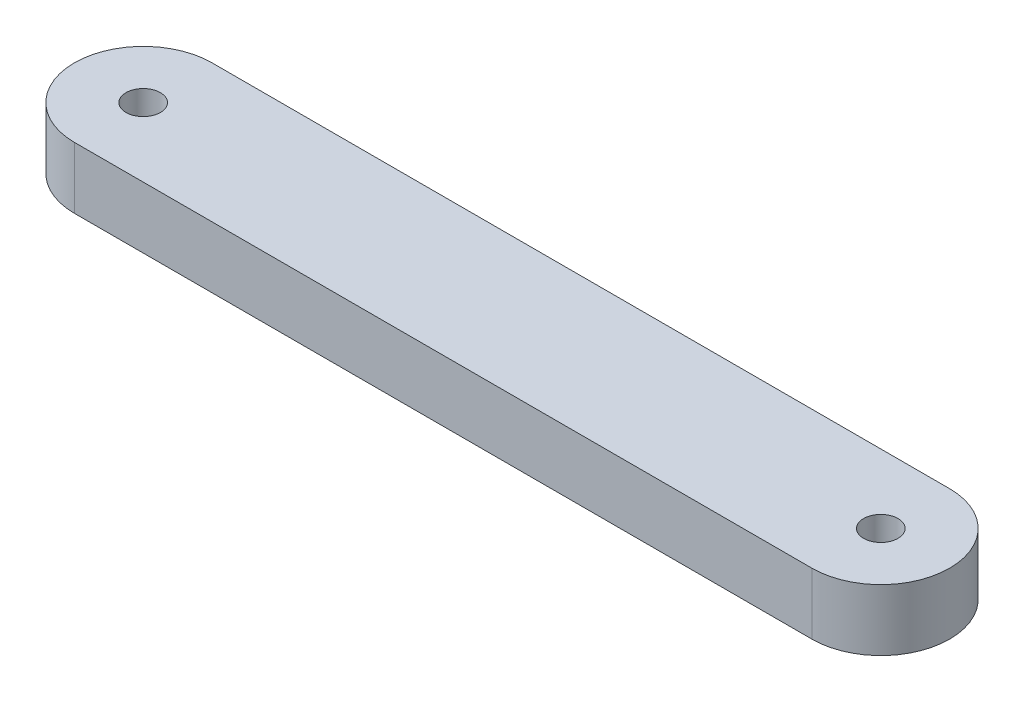
ISO-10303-21;
HEADER;
FILE_DESCRIPTION(('STEP AP214'),'2;1');
FILE_NAME('part.step','',(''),(''),'','','');
FILE_SCHEMA(('AUTOMOTIVE_DESIGN { 1 0 10303 214 1 1 1 1 }'));
ENDSEC;
DATA;
#1=APPLICATION_CONTEXT('core data for automotive mechanical design processes');
#2=APPLICATION_PROTOCOL_DEFINITION('international standard','automotive_design',2000,#1);
#3=PRODUCT_CONTEXT('',#1,'mechanical');
#4=PRODUCT('Part','Part','',(#3));
#5=PRODUCT_RELATED_PRODUCT_CATEGORY('part','',(#4));
#6=PRODUCT_DEFINITION_FORMATION('','',#4);
#7=PRODUCT_DEFINITION_CONTEXT('part definition',#1,'design');
#8=PRODUCT_DEFINITION('design','',#6,#7);
#9=PRODUCT_DEFINITION_SHAPE('','',#8);
#10=(LENGTH_UNIT() NAMED_UNIT(*) SI_UNIT(.MILLI.,.METRE.));
#11=(NAMED_UNIT(*) PLANE_ANGLE_UNIT() SI_UNIT($,.RADIAN.));
#12=(NAMED_UNIT(*) SI_UNIT($,.STERADIAN.) SOLID_ANGLE_UNIT());
#13=UNCERTAINTY_MEASURE_WITH_UNIT(LENGTH_MEASURE(1.E-05),#10,'distance_accuracy_value','');
#14=(GEOMETRIC_REPRESENTATION_CONTEXT(3) GLOBAL_UNCERTAINTY_ASSIGNED_CONTEXT((#13)) GLOBAL_UNIT_ASSIGNED_CONTEXT((#10,
#11,#12)) REPRESENTATION_CONTEXT('',''));
#15=CARTESIAN_POINT('',(0.,0.,0.));
#16=DIRECTION('',(0.,0.,1.));
#17=DIRECTION('',(1.,0.,0.));
#18=AXIS2_PLACEMENT_3D('',#15,#16,#17);
#19=CARTESIAN_POINT('',(0.,25.,28.));
#20=DIRECTION('',(0.,0.,1.));
#21=DIRECTION('',(1.,0.,0.));
#22=AXIS2_PLACEMENT_3D('',#19,#20,#21);
#23=PLANE('',#22);
#24=DIRECTION('',(-1.,0.,0.));
#25=VECTOR('',#24,1.);
#26=CARTESIAN_POINT('',(0.,0.,28.));
#27=LINE('',#26,#25);
#28=CARTESIAN_POINT('',(150.,0.,28.));
#29=VERTEX_POINT('',#28);
#30=CARTESIAN_POINT('',(-150.,0.,28.));
#31=VERTEX_POINT('',#30);
#32=EDGE_CURVE('E108',#29,#31,#27,.T.);
#33=ORIENTED_EDGE('',*,*,#32,.F.);
#34=DIRECTION('',(0.,-1.,0.));
#35=VECTOR('',#34,1.);
#36=CARTESIAN_POINT('',(150.,25.,28.));
#37=LINE('',#36,#35);
#38=CARTESIAN_POINT('',(150.,25.,28.));
#39=VERTEX_POINT('',#38);
#40=EDGE_CURVE('E11',#39,#29,#37,.T.);
#41=ORIENTED_EDGE('',*,*,#40,.F.);
#42=DIRECTION('',(-1.,0.,0.));
#43=VECTOR('',#42,1.);
#44=CARTESIAN_POINT('',(0.,25.,28.));
#45=LINE('',#44,#43);
#46=CARTESIAN_POINT('',(-150.,25.,28.));
#47=VERTEX_POINT('',#46);
#48=EDGE_CURVE('E95',#39,#47,#45,.T.);
#49=ORIENTED_EDGE('',*,*,#48,.T.);
#50=DIRECTION('',(0.,-1.,0.));
#51=VECTOR('',#50,1.);
#52=CARTESIAN_POINT('',(-150.,25.,28.));
#53=LINE('',#52,#51);
#54=EDGE_CURVE('E76',#47,#31,#53,.T.);
#55=ORIENTED_EDGE('',*,*,#54,.T.);
#56=EDGE_LOOP('',(#33,#41,#49,#55));
#57=FACE_BOUND('',#56,.T.);
#58=ADVANCED_FACE('F38',(#57),#23,.T.);
#59=CARTESIAN_POINT('',(150.,25.,0.));
#60=DIRECTION('',(0.,-1.,0.));
#61=DIRECTION('',(0.,0.,-1.));
#62=AXIS2_PLACEMENT_3D('',#59,#60,#61);
#63=CYLINDRICAL_SURFACE('',#62,28.);
#64=CARTESIAN_POINT('',(150.,0.,0.));
#65=DIRECTION('',(0.,1.,0.));
#66=DIRECTION('',(0.,0.,1.));
#67=AXIS2_PLACEMENT_3D('',#64,#65,#66);
#68=CIRCLE('',#67,28.);
#69=CARTESIAN_POINT('',(150.,0.,-28.0000000000001));
#70=VERTEX_POINT('',#69);
#71=EDGE_CURVE('E87',#70,#29,#68,.F.);
#72=ORIENTED_EDGE('',*,*,#71,.F.);
#73=DIRECTION('',(0.,-1.,0.));
#74=VECTOR('',#73,1.);
#75=CARTESIAN_POINT('',(150.,25.,-28.0000000000001));
#76=LINE('',#75,#74);
#77=CARTESIAN_POINT('',(150.,25.,-28.0000000000001));
#78=VERTEX_POINT('',#77);
#79=EDGE_CURVE('E46',#78,#70,#76,.T.);
#80=ORIENTED_EDGE('',*,*,#79,.F.);
#81=CARTESIAN_POINT('',(150.,25.,0.));
#82=DIRECTION('',(0.,1.,0.));
#83=DIRECTION('',(0.,0.,1.));
#84=AXIS2_PLACEMENT_3D('',#81,#82,#83);
#85=CIRCLE('',#84,28.);
#86=EDGE_CURVE('E85',#78,#39,#85,.F.);
#87=ORIENTED_EDGE('',*,*,#86,.T.);
#88=ORIENTED_EDGE('',*,*,#40,.T.);
#89=EDGE_LOOP('',(#72,#80,#87,#88));
#90=FACE_BOUND('',#89,.T.);
#91=ADVANCED_FACE('F84',(#90),#63,.T.);
#92=CARTESIAN_POINT('',(0.,25.,-28.0000000000001));
#93=DIRECTION('',(0.,0.,-1.));
#94=DIRECTION('',(-1.,0.,0.));
#95=AXIS2_PLACEMENT_3D('',#92,#93,#94);
#96=PLANE('',#95);
#97=DIRECTION('',(1.,0.,0.));
#98=VECTOR('',#97,1.);
#99=CARTESIAN_POINT('',(0.,0.,-28.0000000000001));
#100=LINE('',#99,#98);
#101=CARTESIAN_POINT('',(-150.,0.,-28.));
#102=VERTEX_POINT('',#101);
#103=EDGE_CURVE('E112',#102,#70,#100,.T.);
#104=ORIENTED_EDGE('',*,*,#103,.F.);
#105=DIRECTION('',(0.,-1.,0.));
#106=VECTOR('',#105,1.);
#107=CARTESIAN_POINT('',(-150.,25.,-28.));
#108=LINE('',#107,#106);
#109=CARTESIAN_POINT('',(-150.,25.,-28.));
#110=VERTEX_POINT('',#109);
#111=EDGE_CURVE('E69',#110,#102,#108,.T.);
#112=ORIENTED_EDGE('',*,*,#111,.F.);
#113=DIRECTION('',(1.,0.,0.));
#114=VECTOR('',#113,1.);
#115=CARTESIAN_POINT('',(0.,25.,-28.0000000000001));
#116=LINE('',#115,#114);
#117=EDGE_CURVE('E94',#110,#78,#116,.T.);
#118=ORIENTED_EDGE('',*,*,#117,.T.);
#119=ORIENTED_EDGE('',*,*,#79,.T.);
#120=EDGE_LOOP('',(#104,#112,#118,#119));
#121=FACE_BOUND('',#120,.T.);
#122=ADVANCED_FACE('F97',(#121),#96,.T.);
#123=CARTESIAN_POINT('',(-150.,25.,0.));
#124=DIRECTION('',(0.,-1.,0.));
#125=DIRECTION('',(0.,0.,-1.));
#126=AXIS2_PLACEMENT_3D('',#123,#124,#125);
#127=CYLINDRICAL_SURFACE('',#126,7.00000000000001);
#128=CARTESIAN_POINT('',(-150.,25.,0.));
#129=DIRECTION('',(0.,1.,0.));
#130=DIRECTION('',(0.,0.,1.));
#131=AXIS2_PLACEMENT_3D('',#128,#129,#130);
#132=CIRCLE('',#131,7.00000000000001);
#133=CARTESIAN_POINT('',(-150.,25.,7.00000000000001));
#134=VERTEX_POINT('',#133);
#135=EDGE_CURVE('E99',#134,#134,#132,.T.);
#136=ORIENTED_EDGE('',*,*,#135,.T.);
#137=EDGE_LOOP('',(#136));
#138=FACE_BOUND('',#137,.T.);
#139=CARTESIAN_POINT('',(-150.,0.,0.));
#140=DIRECTION('',(0.,1.,0.));
#141=DIRECTION('',(0.,0.,1.));
#142=AXIS2_PLACEMENT_3D('',#139,#140,#141);
#143=CIRCLE('',#142,7.00000000000001);
#144=CARTESIAN_POINT('',(-150.,0.,7.00000000000001));
#145=VERTEX_POINT('',#144);
#146=EDGE_CURVE('E116',#145,#145,#143,.T.);
#147=ORIENTED_EDGE('',*,*,#146,.F.);
#148=EDGE_LOOP('',(#147));
#149=FACE_BOUND('',#148,.T.);
#150=ADVANCED_FACE('F132',(#138,#149),#127,.F.);
#151=CARTESIAN_POINT('',(-150.,25.,0.));
#152=DIRECTION('',(0.,-1.,0.));
#153=DIRECTION('',(0.,0.,-1.));
#154=AXIS2_PLACEMENT_3D('',#151,#152,#153);
#155=CYLINDRICAL_SURFACE('',#154,28.);
#156=CARTESIAN_POINT('',(-150.,0.,0.));
#157=DIRECTION('',(0.,1.,0.));
#158=DIRECTION('',(0.,0.,1.));
#159=AXIS2_PLACEMENT_3D('',#156,#157,#158);
#160=CIRCLE('',#159,28.);
#161=EDGE_CURVE('E114',#102,#31,#160,.T.);
#162=ORIENTED_EDGE('',*,*,#161,.T.);
#163=ORIENTED_EDGE('',*,*,#54,.F.);
#164=CARTESIAN_POINT('',(-150.,25.,0.));
#165=DIRECTION('',(0.,1.,0.));
#166=DIRECTION('',(0.,0.,1.));
#167=AXIS2_PLACEMENT_3D('',#164,#165,#166);
#168=CIRCLE('',#167,28.);
#169=EDGE_CURVE('E54',#110,#47,#168,.T.);
#170=ORIENTED_EDGE('',*,*,#169,.F.);
#171=ORIENTED_EDGE('',*,*,#111,.T.);
#172=EDGE_LOOP('',(#162,#163,#170,#171));
#173=FACE_BOUND('',#172,.T.);
#174=ADVANCED_FACE('F135',(#173),#155,.T.);
#175=CARTESIAN_POINT('',(150.,25.,0.));
#176=DIRECTION('',(0.,-1.,0.));
#177=DIRECTION('',(0.,0.,-1.));
#178=AXIS2_PLACEMENT_3D('',#175,#176,#177);
#179=CYLINDRICAL_SURFACE('',#178,7.00000000000001);
#180=CARTESIAN_POINT('',(150.,25.,0.));
#181=DIRECTION('',(0.,1.,0.));
#182=DIRECTION('',(0.,0.,1.));
#183=AXIS2_PLACEMENT_3D('',#180,#181,#182);
#184=CIRCLE('',#183,7.00000000000001);
#185=CARTESIAN_POINT('',(150.,25.,6.99999999999998));
#186=VERTEX_POINT('',#185);
#187=EDGE_CURVE('E105',#186,#186,#184,.F.);
#188=ORIENTED_EDGE('',*,*,#187,.F.);
#189=EDGE_LOOP('',(#188));
#190=FACE_BOUND('',#189,.T.);
#191=CARTESIAN_POINT('',(150.,0.,0.));
#192=DIRECTION('',(0.,1.,0.));
#193=DIRECTION('',(0.,0.,1.));
#194=AXIS2_PLACEMENT_3D('',#191,#192,#193);
#195=CIRCLE('',#194,7.00000000000001);
#196=CARTESIAN_POINT('',(150.,0.,6.99999999999998));
#197=VERTEX_POINT('',#196);
#198=EDGE_CURVE('E119',#197,#197,#195,.F.);
#199=ORIENTED_EDGE('',*,*,#198,.T.);
#200=EDGE_LOOP('',(#199));
#201=FACE_BOUND('',#200,.T.);
#202=ADVANCED_FACE('F138',(#190,#201),#179,.F.);
#203=CARTESIAN_POINT('',(0.,25.,0.));
#204=DIRECTION('',(0.,1.,0.));
#205=DIRECTION('',(0.,0.,1.));
#206=AXIS2_PLACEMENT_3D('',#203,#204,#205);
#207=PLANE('',#206);
#208=ORIENTED_EDGE('',*,*,#48,.F.);
#209=ORIENTED_EDGE('',*,*,#86,.F.);
#210=ORIENTED_EDGE('',*,*,#117,.F.);
#211=ORIENTED_EDGE('',*,*,#169,.T.);
#212=EDGE_LOOP('',(#208,#209,#210,#211));
#213=FACE_BOUND('',#212,.T.);
#214=ORIENTED_EDGE('',*,*,#135,.F.);
#215=EDGE_LOOP('',(#214));
#216=FACE_BOUND('',#215,.T.);
#217=ORIENTED_EDGE('',*,*,#187,.T.);
#218=EDGE_LOOP('',(#217));
#219=FACE_BOUND('',#218,.T.);
#220=ADVANCED_FACE('F92',(#213,#216,#219),#207,.T.);
#221=CARTESIAN_POINT('',(0.,0.,0.));
#222=DIRECTION('',(0.,1.,0.));
#223=DIRECTION('',(0.,0.,1.));
#224=AXIS2_PLACEMENT_3D('',#221,#222,#223);
#225=PLANE('',#224);
#226=ORIENTED_EDGE('',*,*,#32,.T.);
#227=ORIENTED_EDGE('',*,*,#161,.F.);
#228=ORIENTED_EDGE('',*,*,#103,.T.);
#229=ORIENTED_EDGE('',*,*,#71,.T.);
#230=EDGE_LOOP('',(#226,#227,#228,#229));
#231=FACE_BOUND('',#230,.T.);
#232=ORIENTED_EDGE('',*,*,#146,.T.);
#233=EDGE_LOOP('',(#232));
#234=FACE_BOUND('',#233,.T.);
#235=ORIENTED_EDGE('',*,*,#198,.F.);
#236=EDGE_LOOP('',(#235));
#237=FACE_BOUND('',#236,.T.);
#238=ADVANCED_FACE('F145',(#231,#234,#237),#225,.F.);
#239=CLOSED_SHELL('',(#58,#91,#122,#150,#174,#202,#220,#238));
#240=MANIFOLD_SOLID_BREP('B2',#239);
#241=ADVANCED_BREP_SHAPE_REPRESENTATION('',(#18,#240),#14);
#242=SHAPE_DEFINITION_REPRESENTATION(#9,#241);
ENDSEC;
END-ISO-10303-21;
